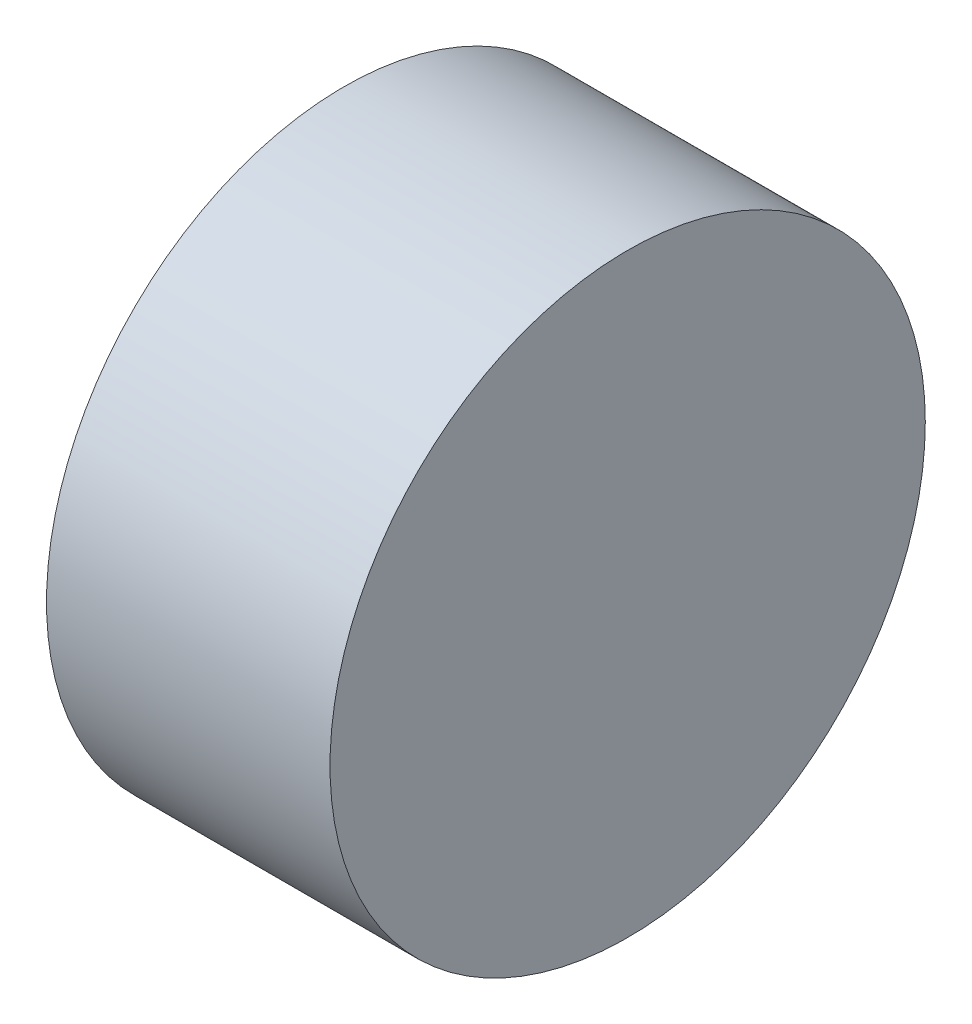
ISO-10303-21;
HEADER;
FILE_DESCRIPTION(('STEP AP214'),'2;1');
FILE_NAME('part.step','',(''),(''),'','','');
FILE_SCHEMA(('AUTOMOTIVE_DESIGN { 1 0 10303 214 1 1 1 1 }'));
ENDSEC;
DATA;
#1=APPLICATION_CONTEXT('core data for automotive mechanical design processes');
#2=APPLICATION_PROTOCOL_DEFINITION('international standard','automotive_design',2000,#1);
#3=PRODUCT_CONTEXT('',#1,'mechanical');
#4=PRODUCT('Part','Part','',(#3));
#5=PRODUCT_RELATED_PRODUCT_CATEGORY('part','',(#4));
#6=PRODUCT_DEFINITION_FORMATION('','',#4);
#7=PRODUCT_DEFINITION_CONTEXT('part definition',#1,'design');
#8=PRODUCT_DEFINITION('design','',#6,#7);
#9=PRODUCT_DEFINITION_SHAPE('','',#8);
#10=(LENGTH_UNIT() NAMED_UNIT(*) SI_UNIT(.MILLI.,.METRE.));
#11=(NAMED_UNIT(*) PLANE_ANGLE_UNIT() SI_UNIT($,.RADIAN.));
#12=(NAMED_UNIT(*) SI_UNIT($,.STERADIAN.) SOLID_ANGLE_UNIT());
#13=UNCERTAINTY_MEASURE_WITH_UNIT(LENGTH_MEASURE(1.E-05),#10,'distance_accuracy_value','');
#14=(GEOMETRIC_REPRESENTATION_CONTEXT(3) GLOBAL_UNCERTAINTY_ASSIGNED_CONTEXT((#13)) GLOBAL_UNIT_ASSIGNED_CONTEXT((#10,
#11,#12)) REPRESENTATION_CONTEXT('',''));
#15=CARTESIAN_POINT('',(0.,0.,0.));
#16=DIRECTION('',(0.,0.,1.));
#17=DIRECTION('',(1.,0.,0.));
#18=AXIS2_PLACEMENT_3D('',#15,#16,#17);
#19=CARTESIAN_POINT('',(61.72,0.,0.));
#20=DIRECTION('',(-1.,0.,0.));
#21=DIRECTION('',(0.,0.,1.));
#22=AXIS2_PLACEMENT_3D('',#19,#20,#21);
#23=CYLINDRICAL_SURFACE('',#22,64.8);
#24=CARTESIAN_POINT('',(61.72,0.,0.));
#25=DIRECTION('',(1.,0.,0.));
#26=DIRECTION('',(0.,0.,-1.));
#27=AXIS2_PLACEMENT_3D('',#24,#25,#26);
#28=CIRCLE('',#27,64.8);
#29=CARTESIAN_POINT('',(61.72,0.,-64.8));
#30=VERTEX_POINT('',#29);
#31=EDGE_CURVE('E10',#30,#30,#28,.T.);
#32=ORIENTED_EDGE('',*,*,#31,.F.);
#33=EDGE_LOOP('',(#32));
#34=FACE_BOUND('',#33,.T.);
#35=CARTESIAN_POINT('',(0.,0.,0.));
#36=DIRECTION('',(1.,0.,0.));
#37=DIRECTION('',(0.,0.,-1.));
#38=AXIS2_PLACEMENT_3D('',#35,#36,#37);
#39=CIRCLE('',#38,64.8);
#40=CARTESIAN_POINT('',(0.,0.,-64.8));
#41=VERTEX_POINT('',#40);
#42=EDGE_CURVE('E33',#41,#41,#39,.T.);
#43=ORIENTED_EDGE('',*,*,#42,.T.);
#44=EDGE_LOOP('',(#43));
#45=FACE_BOUND('',#44,.T.);
#46=ADVANCED_FACE('F30',(#34,#45),#23,.T.);
#47=CARTESIAN_POINT('',(61.72,0.,0.));
#48=DIRECTION('',(1.,0.,0.));
#49=DIRECTION('',(0.,0.,-1.));
#50=AXIS2_PLACEMENT_3D('',#47,#48,#49);
#51=PLANE('',#50);
#52=ORIENTED_EDGE('',*,*,#31,.T.);
#53=EDGE_LOOP('',(#52));
#54=FACE_BOUND('',#53,.T.);
#55=ADVANCED_FACE('F45',(#54),#51,.T.);
#56=CARTESIAN_POINT('',(0.,0.,0.));
#57=DIRECTION('',(1.,0.,0.));
#58=DIRECTION('',(0.,0.,-1.));
#59=AXIS2_PLACEMENT_3D('',#56,#57,#58);
#60=PLANE('',#59);
#61=ORIENTED_EDGE('',*,*,#42,.F.);
#62=EDGE_LOOP('',(#61));
#63=FACE_BOUND('',#62,.T.);
#64=ADVANCED_FACE('F43',(#63),#60,.F.);
#65=CLOSED_SHELL('',(#46,#55,#64));
#66=MANIFOLD_SOLID_BREP('B2',#65);
#67=ADVANCED_BREP_SHAPE_REPRESENTATION('',(#18,#66),#14);
#68=SHAPE_DEFINITION_REPRESENTATION(#9,#67);
ENDSEC;
END-ISO-10303-21;
